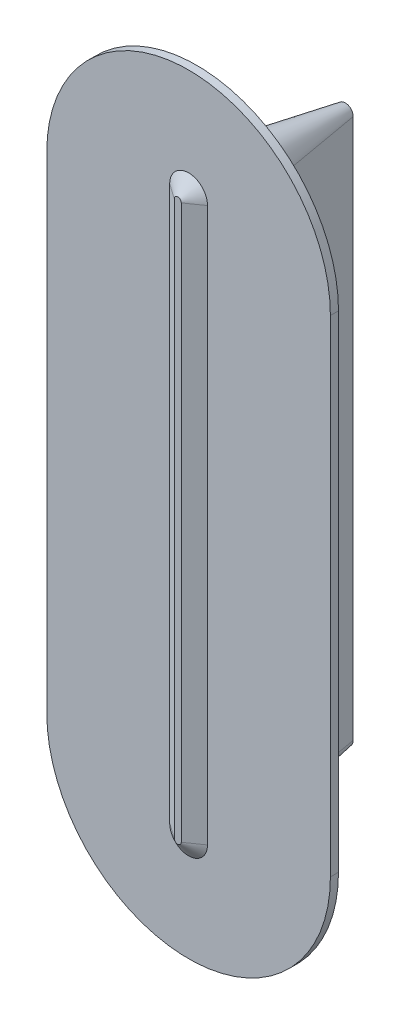
ISO-10303-21;
HEADER;
FILE_DESCRIPTION(('STEP AP214'),'2;1');
FILE_NAME('part.step','',(''),(''),'','','');
FILE_SCHEMA(('AUTOMOTIVE_DESIGN { 1 0 10303 214 1 1 1 1 }'));
ENDSEC;
DATA;
#1=APPLICATION_CONTEXT('core data for automotive mechanical design processes');
#2=APPLICATION_PROTOCOL_DEFINITION('international standard','automotive_design',2000,#1);
#3=PRODUCT_CONTEXT('',#1,'mechanical');
#4=PRODUCT('Part','Part','',(#3));
#5=PRODUCT_RELATED_PRODUCT_CATEGORY('part','',(#4));
#6=PRODUCT_DEFINITION_FORMATION('','',#4);
#7=PRODUCT_DEFINITION_CONTEXT('part definition',#1,'design');
#8=PRODUCT_DEFINITION('design','',#6,#7);
#9=PRODUCT_DEFINITION_SHAPE('','',#8);
#10=(LENGTH_UNIT() NAMED_UNIT(*) SI_UNIT(.MILLI.,.METRE.));
#11=(NAMED_UNIT(*) PLANE_ANGLE_UNIT() SI_UNIT($,.RADIAN.));
#12=(NAMED_UNIT(*) SI_UNIT($,.STERADIAN.) SOLID_ANGLE_UNIT());
#13=UNCERTAINTY_MEASURE_WITH_UNIT(LENGTH_MEASURE(1.E-05),#10,'distance_accuracy_value','');
#14=(GEOMETRIC_REPRESENTATION_CONTEXT(3) GLOBAL_UNCERTAINTY_ASSIGNED_CONTEXT((#13)) GLOBAL_UNIT_ASSIGNED_CONTEXT((#10,
#11,#12)) REPRESENTATION_CONTEXT('',''));
#15=CARTESIAN_POINT('',(0.,0.,0.));
#16=DIRECTION('',(0.,0.,1.));
#17=DIRECTION('',(1.,0.,0.));
#18=AXIS2_PLACEMENT_3D('',#15,#16,#17);
#19=CARTESIAN_POINT('',(0.,-90.,18.));
#20=DIRECTION('',(0.,0.,1.));
#21=DIRECTION('',(1.,0.,0.));
#22=AXIS2_PLACEMENT_3D('',#19,#20,#21);
#23=PLANE('',#22);
#24=CARTESIAN_POINT('',(0.,-90.,18.));
#25=DIRECTION('',(0.,0.,1.));
#26=DIRECTION('',(1.,0.,0.));
#27=AXIS2_PLACEMENT_3D('',#24,#25,#26);
#28=CIRCLE('',#27,52.5);
#29=CARTESIAN_POINT('',(-52.5,-90.,18.));
#30=VERTEX_POINT('',#29);
#31=CARTESIAN_POINT('',(52.5,-90.,18.));
#32=VERTEX_POINT('',#31);
#33=EDGE_CURVE('E203',#30,#32,#28,.T.);
#34=ORIENTED_EDGE('',*,*,#33,.T.);
#35=DIRECTION('',(0.,1.,0.));
#36=VECTOR('',#35,1.);
#37=CARTESIAN_POINT('',(52.5,-90.,18.));
#38=LINE('',#37,#36);
#39=CARTESIAN_POINT('',(52.5,90.,18.));
#40=VERTEX_POINT('',#39);
#41=EDGE_CURVE('E207',#32,#40,#38,.T.);
#42=ORIENTED_EDGE('',*,*,#41,.T.);
#43=CARTESIAN_POINT('',(0.,90.,18.));
#44=DIRECTION('',(0.,0.,1.));
#45=DIRECTION('',(1.,0.,0.));
#46=AXIS2_PLACEMENT_3D('',#43,#44,#45);
#47=CIRCLE('',#46,52.5);
#48=CARTESIAN_POINT('',(-52.5,90.,18.));
#49=VERTEX_POINT('',#48);
#50=EDGE_CURVE('E211',#40,#49,#47,.T.);
#51=ORIENTED_EDGE('',*,*,#50,.T.);
#52=DIRECTION('',(0.,-1.,0.));
#53=VECTOR('',#52,1.);
#54=CARTESIAN_POINT('',(-52.5,-90.,18.));
#55=LINE('',#54,#53);
#56=EDGE_CURVE('E214',#49,#30,#55,.T.);
#57=ORIENTED_EDGE('',*,*,#56,.T.);
#58=EDGE_LOOP('',(#34,#42,#51,#57));
#59=FACE_BOUND('',#58,.T.);
#60=DIRECTION('',(0.,1.,0.));
#61=VECTOR('',#60,1.);
#62=CARTESIAN_POINT('',(7.,-102.5,18.));
#63=LINE('',#62,#61);
#64=CARTESIAN_POINT('',(7.,-102.5,18.));
#65=VERTEX_POINT('',#64);
#66=CARTESIAN_POINT('',(6.99999999999996,102.5,18.));
#67=VERTEX_POINT('',#66);
#68=EDGE_CURVE('E154',#65,#67,#63,.T.);
#69=ORIENTED_EDGE('',*,*,#68,.F.);
#70=CARTESIAN_POINT('',(0.,-102.5,18.));
#71=DIRECTION('',(0.,0.,1.));
#72=DIRECTION('',(1.,0.,0.));
#73=AXIS2_PLACEMENT_3D('',#70,#71,#72);
#74=CIRCLE('',#73,6.99999999999999);
#75=CARTESIAN_POINT('',(-6.99999999999998,-102.5,18.));
#76=VERTEX_POINT('',#75);
#77=EDGE_CURVE('E166',#76,#65,#74,.T.);
#78=ORIENTED_EDGE('',*,*,#77,.F.);
#79=DIRECTION('',(0.,-1.,0.));
#80=VECTOR('',#79,1.);
#81=CARTESIAN_POINT('',(-6.99999999999998,-102.5,18.));
#82=LINE('',#81,#80);
#83=CARTESIAN_POINT('',(-7.,102.5,18.));
#84=VERTEX_POINT('',#83);
#85=EDGE_CURVE('E181',#84,#76,#82,.T.);
#86=ORIENTED_EDGE('',*,*,#85,.F.);
#87=CARTESIAN_POINT('',(0.,102.5,18.));
#88=DIRECTION('',(0.,0.,1.));
#89=DIRECTION('',(1.,0.,0.));
#90=AXIS2_PLACEMENT_3D('',#87,#88,#89);
#91=CIRCLE('',#90,7.);
#92=EDGE_CURVE('E175',#67,#84,#91,.T.);
#93=ORIENTED_EDGE('',*,*,#92,.F.);
#94=EDGE_LOOP('',(#69,#78,#86,#93));
#95=FACE_BOUND('',#94,.T.);
#96=ADVANCED_FACE('F36',(#59,#95),#23,.T.);
#97=CARTESIAN_POINT('',(0.,-100.,0.));
#98=DIRECTION('',(0.,0.,1.));
#99=DIRECTION('',(1.,0.,0.));
#100=AXIS2_PLACEMENT_3D('',#97,#98,#99);
#101=CONICAL_SURFACE('',#100,9.99999999999999,0.174532925199433);
#102=CARTESIAN_POINT('',(0.,-100.,0.));
#103=DIRECTION('',(0.,0.,1.));
#104=DIRECTION('',(1.,0.,0.));
#105=AXIS2_PLACEMENT_3D('',#102,#103,#104);
#106=CIRCLE('',#105,9.99999999999999);
#107=CARTESIAN_POINT('',(-9.99999999999998,-100.,0.));
#108=VERTEX_POINT('',#107);
#109=CARTESIAN_POINT('',(10.,-100.,0.));
#110=VERTEX_POINT('',#109);
#111=EDGE_CURVE('E276',#108,#110,#106,.T.);
#112=ORIENTED_EDGE('',*,*,#111,.F.);
#113=DIRECTION('',(-0.173648177666931,0.,0.984807753012208));
#114=VECTOR('',#113,1.);
#115=CARTESIAN_POINT('',(-9.99999999999998,-100.,0.));
#116=LINE('',#115,#114);
#117=CARTESIAN_POINT('',(-2.94692077166136,-100.,-40.));
#118=VERTEX_POINT('',#117);
#119=EDGE_CURVE('E11',#118,#108,#116,.T.);
#120=ORIENTED_EDGE('',*,*,#119,.F.);
#121=CARTESIAN_POINT('',(0.,-100.,-40.));
#122=DIRECTION('',(0.,0.,1.));
#123=DIRECTION('',(1.,0.,0.));
#124=AXIS2_PLACEMENT_3D('',#121,#122,#123);
#125=CIRCLE('',#124,2.94692077166137);
#126=CARTESIAN_POINT('',(2.94692077166137,-100.,-40.));
#127=VERTEX_POINT('',#126);
#128=EDGE_CURVE('E291',#118,#127,#125,.T.);
#129=ORIENTED_EDGE('',*,*,#128,.T.);
#130=DIRECTION('',(0.173648177666931,0.,0.984807753012208));
#131=VECTOR('',#130,1.);
#132=CARTESIAN_POINT('',(9.99999999999999,-100.,0.));
#133=LINE('',#132,#131);
#134=EDGE_CURVE('E77',#127,#110,#133,.T.);
#135=ORIENTED_EDGE('',*,*,#134,.T.);
#136=EDGE_LOOP('',(#112,#120,#129,#135));
#137=FACE_BOUND('',#136,.T.);
#138=ADVANCED_FACE('F310',(#137),#101,.T.);
#139=CARTESIAN_POINT('',(-9.99999999999998,-100.,0.));
#140=DIRECTION('',(-0.984807753012208,0.,-0.173648177666931));
#141=DIRECTION('',(-0.173648177666931,0.,0.984807753012208));
#142=AXIS2_PLACEMENT_3D('',#139,#140,#141);
#143=PLANE('',#142);
#144=DIRECTION('',(0.,-1.,0.));
#145=VECTOR('',#144,1.);
#146=CARTESIAN_POINT('',(-9.99999999999998,-100.,0.));
#147=LINE('',#146,#145);
#148=CARTESIAN_POINT('',(-10.,100.,0.));
#149=VERTEX_POINT('',#148);
#150=EDGE_CURVE('E288',#149,#108,#147,.T.);
#151=ORIENTED_EDGE('',*,*,#150,.F.);
#152=DIRECTION('',(-0.173648177666931,0.,0.984807753012208));
#153=VECTOR('',#152,1.);
#154=CARTESIAN_POINT('',(-10.,100.,0.));
#155=LINE('',#154,#153);
#156=CARTESIAN_POINT('',(-2.94692077166142,100.,-40.));
#157=VERTEX_POINT('',#156);
#158=EDGE_CURVE('E46',#157,#149,#155,.T.);
#159=ORIENTED_EDGE('',*,*,#158,.F.);
#160=DIRECTION('',(0.,-1.,0.));
#161=VECTOR('',#160,1.);
#162=CARTESIAN_POINT('',(-2.94692077166136,-100.,-40.));
#163=LINE('',#162,#161);
#164=EDGE_CURVE('E295',#157,#118,#163,.T.);
#165=ORIENTED_EDGE('',*,*,#164,.T.);
#166=ORIENTED_EDGE('',*,*,#119,.T.);
#167=EDGE_LOOP('',(#151,#159,#165,#166));
#168=FACE_BOUND('',#167,.T.);
#169=ADVANCED_FACE('F38',(#168),#143,.T.);
#170=CARTESIAN_POINT('',(0.,100.,0.));
#171=DIRECTION('',(0.,0.,1.));
#172=DIRECTION('',(1.,0.,0.));
#173=AXIS2_PLACEMENT_3D('',#170,#171,#172);
#174=CONICAL_SURFACE('',#173,10.,0.174532925199433);
#175=CARTESIAN_POINT('',(0.,100.,0.));
#176=DIRECTION('',(0.,0.,1.));
#177=DIRECTION('',(1.,0.,0.));
#178=AXIS2_PLACEMENT_3D('',#175,#176,#177);
#179=CIRCLE('',#178,10.);
#180=CARTESIAN_POINT('',(9.99999999999996,100.,0.));
#181=VERTEX_POINT('',#180);
#182=EDGE_CURVE('E284',#181,#149,#179,.T.);
#183=ORIENTED_EDGE('',*,*,#182,.F.);
#184=DIRECTION('',(0.173648177666931,0.,0.984807753012208));
#185=VECTOR('',#184,1.);
#186=CARTESIAN_POINT('',(10.,100.,0.));
#187=LINE('',#186,#185);
#188=CARTESIAN_POINT('',(2.94692077166139,100.,-40.));
#189=VERTEX_POINT('',#188);
#190=EDGE_CURVE('E87',#189,#181,#187,.T.);
#191=ORIENTED_EDGE('',*,*,#190,.F.);
#192=CARTESIAN_POINT('',(0.,100.,-40.));
#193=DIRECTION('',(0.,0.,1.));
#194=DIRECTION('',(1.,0.,0.));
#195=AXIS2_PLACEMENT_3D('',#192,#193,#194);
#196=CIRCLE('',#195,2.94692077166139);
#197=EDGE_CURVE('E302',#189,#157,#196,.T.);
#198=ORIENTED_EDGE('',*,*,#197,.T.);
#199=ORIENTED_EDGE('',*,*,#158,.T.);
#200=EDGE_LOOP('',(#183,#191,#198,#199));
#201=FACE_BOUND('',#200,.T.);
#202=ADVANCED_FACE('F325',(#201),#174,.T.);
#203=CARTESIAN_POINT('',(10.,-100.,0.));
#204=DIRECTION('',(0.984807753012208,0.,-0.173648177666931));
#205=DIRECTION('',(-0.173648177666931,0.,-0.984807753012208));
#206=AXIS2_PLACEMENT_3D('',#203,#204,#205);
#207=PLANE('',#206);
#208=DIRECTION('',(0.,1.,0.));
#209=VECTOR('',#208,1.);
#210=CARTESIAN_POINT('',(10.,-100.,0.));
#211=LINE('',#210,#209);
#212=EDGE_CURVE('E280',#110,#181,#211,.T.);
#213=ORIENTED_EDGE('',*,*,#212,.F.);
#214=ORIENTED_EDGE('',*,*,#134,.F.);
#215=DIRECTION('',(0.,1.,0.));
#216=VECTOR('',#215,1.);
#217=CARTESIAN_POINT('',(2.94692077166139,-100.,-40.));
#218=LINE('',#217,#216);
#219=EDGE_CURVE('E40',#127,#189,#218,.T.);
#220=ORIENTED_EDGE('',*,*,#219,.T.);
#221=ORIENTED_EDGE('',*,*,#190,.T.);
#222=EDGE_LOOP('',(#213,#214,#220,#221));
#223=FACE_BOUND('',#222,.T.);
#224=ADVANCED_FACE('F307',(#223),#207,.T.);
#225=CARTESIAN_POINT('',(0.,-100.,-40.));
#226=DIRECTION('',(0.,0.,1.));
#227=DIRECTION('',(1.,0.,0.));
#228=AXIS2_PLACEMENT_3D('',#225,#226,#227);
#229=PLANE('',#228);
#230=ORIENTED_EDGE('',*,*,#128,.F.);
#231=ORIENTED_EDGE('',*,*,#164,.F.);
#232=ORIENTED_EDGE('',*,*,#197,.F.);
#233=ORIENTED_EDGE('',*,*,#219,.F.);
#234=EDGE_LOOP('',(#230,#231,#232,#233));
#235=FACE_BOUND('',#234,.T.);
#236=ADVANCED_FACE('F309',(#235),#229,.F.);
#237=CARTESIAN_POINT('',(0.,-100.,15.));
#238=DIRECTION('',(0.,0.,-1.));
#239=DIRECTION('',(-1.,0.,0.));
#240=AXIS2_PLACEMENT_3D('',#237,#238,#239);
#241=CYLINDRICAL_SURFACE('',#240,9.99999999999999);
#242=ORIENTED_EDGE('',*,*,#111,.T.);
#243=DIRECTION('',(0.,0.,-1.));
#244=VECTOR('',#243,1.);
#245=CARTESIAN_POINT('',(10.,-100.,15.));
#246=LINE('',#245,#244);
#247=CARTESIAN_POINT('',(10.,-100.,15.));
#248=VERTEX_POINT('',#247);
#249=EDGE_CURVE('E272',#248,#110,#246,.T.);
#250=ORIENTED_EDGE('',*,*,#249,.F.);
#251=CARTESIAN_POINT('',(0.,-100.,15.));
#252=DIRECTION('',(0.,0.,1.));
#253=DIRECTION('',(1.,0.,0.));
#254=AXIS2_PLACEMENT_3D('',#251,#252,#253);
#255=CIRCLE('',#254,9.99999999999999);
#256=CARTESIAN_POINT('',(-9.99999999999998,-100.,15.));
#257=VERTEX_POINT('',#256);
#258=EDGE_CURVE('E244',#257,#248,#255,.T.);
#259=ORIENTED_EDGE('',*,*,#258,.F.);
#260=DIRECTION('',(0.,0.,-1.));
#261=VECTOR('',#260,1.);
#262=CARTESIAN_POINT('',(-9.99999999999998,-100.,15.));
#263=LINE('',#262,#261);
#264=EDGE_CURVE('E260',#257,#108,#263,.T.);
#265=ORIENTED_EDGE('',*,*,#264,.T.);
#266=EDGE_LOOP('',(#242,#250,#259,#265));
#267=FACE_BOUND('',#266,.T.);
#268=ADVANCED_FACE('F315',(#267),#241,.T.);
#269=CARTESIAN_POINT('',(10.,-100.,15.));
#270=DIRECTION('',(-1.,0.,0.));
#271=DIRECTION('',(0.,0.,1.));
#272=AXIS2_PLACEMENT_3D('',#269,#270,#271);
#273=PLANE('',#272);
#274=ORIENTED_EDGE('',*,*,#212,.T.);
#275=DIRECTION('',(0.,0.,-1.));
#276=VECTOR('',#275,1.);
#277=CARTESIAN_POINT('',(9.99999999999996,100.,15.));
#278=LINE('',#277,#276);
#279=CARTESIAN_POINT('',(9.99999999999996,100.,15.));
#280=VERTEX_POINT('',#279);
#281=EDGE_CURVE('E268',#280,#181,#278,.T.);
#282=ORIENTED_EDGE('',*,*,#281,.F.);
#283=DIRECTION('',(0.,1.,0.));
#284=VECTOR('',#283,1.);
#285=CARTESIAN_POINT('',(10.,-100.,15.));
#286=LINE('',#285,#284);
#287=EDGE_CURVE('E248',#248,#280,#286,.T.);
#288=ORIENTED_EDGE('',*,*,#287,.F.);
#289=ORIENTED_EDGE('',*,*,#249,.T.);
#290=EDGE_LOOP('',(#274,#282,#288,#289));
#291=FACE_BOUND('',#290,.T.);
#292=ADVANCED_FACE('F313',(#291),#273,.F.);
#293=CARTESIAN_POINT('',(0.,100.,15.));
#294=DIRECTION('',(0.,0.,-1.));
#295=DIRECTION('',(-1.,0.,0.));
#296=AXIS2_PLACEMENT_3D('',#293,#294,#295);
#297=CYLINDRICAL_SURFACE('',#296,10.);
#298=ORIENTED_EDGE('',*,*,#182,.T.);
#299=DIRECTION('',(0.,0.,-1.));
#300=VECTOR('',#299,1.);
#301=CARTESIAN_POINT('',(-10.,100.,15.));
#302=LINE('',#301,#300);
#303=CARTESIAN_POINT('',(-10.,100.,15.));
#304=VERTEX_POINT('',#303);
#305=EDGE_CURVE('E264',#304,#149,#302,.T.);
#306=ORIENTED_EDGE('',*,*,#305,.F.);
#307=CARTESIAN_POINT('',(0.,100.,15.));
#308=DIRECTION('',(0.,0.,1.));
#309=DIRECTION('',(1.,0.,0.));
#310=AXIS2_PLACEMENT_3D('',#307,#308,#309);
#311=CIRCLE('',#310,10.);
#312=EDGE_CURVE('E252',#280,#304,#311,.T.);
#313=ORIENTED_EDGE('',*,*,#312,.F.);
#314=ORIENTED_EDGE('',*,*,#281,.T.);
#315=EDGE_LOOP('',(#298,#306,#313,#314));
#316=FACE_BOUND('',#315,.T.);
#317=ADVANCED_FACE('F324',(#316),#297,.T.);
#318=CARTESIAN_POINT('',(-9.99999999999998,-100.,15.));
#319=DIRECTION('',(1.,0.,0.));
#320=DIRECTION('',(0.,1.,0.));
#321=AXIS2_PLACEMENT_3D('',#318,#319,#320);
#322=PLANE('',#321);
#323=ORIENTED_EDGE('',*,*,#150,.T.);
#324=ORIENTED_EDGE('',*,*,#264,.F.);
#325=DIRECTION('',(0.,-1.,0.));
#326=VECTOR('',#325,1.);
#327=CARTESIAN_POINT('',(-9.99999999999998,-100.,15.));
#328=LINE('',#327,#326);
#329=EDGE_CURVE('E256',#304,#257,#328,.T.);
#330=ORIENTED_EDGE('',*,*,#329,.F.);
#331=ORIENTED_EDGE('',*,*,#305,.T.);
#332=EDGE_LOOP('',(#323,#324,#330,#331));
#333=FACE_BOUND('',#332,.T.);
#334=ADVANCED_FACE('F319',(#333),#322,.F.);
#335=CARTESIAN_POINT('',(0.,-90.,15.));
#336=DIRECTION('',(0.,0.,1.));
#337=DIRECTION('',(1.,0.,0.));
#338=AXIS2_PLACEMENT_3D('',#335,#336,#337);
#339=PLANE('',#338);
#340=CARTESIAN_POINT('',(0.,-90.,15.));
#341=DIRECTION('',(0.,0.,1.));
#342=DIRECTION('',(1.,0.,0.));
#343=AXIS2_PLACEMENT_3D('',#340,#341,#342);
#344=CIRCLE('',#343,52.5);
#345=CARTESIAN_POINT('',(-52.5,-90.,15.));
#346=VERTEX_POINT('',#345);
#347=CARTESIAN_POINT('',(52.5,-90.,15.));
#348=VERTEX_POINT('',#347);
#349=EDGE_CURVE('E161',#346,#348,#344,.T.);
#350=ORIENTED_EDGE('',*,*,#349,.F.);
#351=DIRECTION('',(0.,-1.,0.));
#352=VECTOR('',#351,1.);
#353=CARTESIAN_POINT('',(-52.5,-90.,15.));
#354=LINE('',#353,#352);
#355=CARTESIAN_POINT('',(-52.5,90.,15.));
#356=VERTEX_POINT('',#355);
#357=EDGE_CURVE('E208',#356,#346,#354,.T.);
#358=ORIENTED_EDGE('',*,*,#357,.F.);
#359=CARTESIAN_POINT('',(0.,90.,15.));
#360=DIRECTION('',(0.,0.,1.));
#361=DIRECTION('',(1.,0.,0.));
#362=AXIS2_PLACEMENT_3D('',#359,#360,#361);
#363=CIRCLE('',#362,52.5);
#364=CARTESIAN_POINT('',(52.5,90.,15.));
#365=VERTEX_POINT('',#364);
#366=EDGE_CURVE('E224',#365,#356,#363,.T.);
#367=ORIENTED_EDGE('',*,*,#366,.F.);
#368=DIRECTION('',(0.,1.,0.));
#369=VECTOR('',#368,1.);
#370=CARTESIAN_POINT('',(52.5,-90.,15.));
#371=LINE('',#370,#369);
#372=EDGE_CURVE('E221',#348,#365,#371,.T.);
#373=ORIENTED_EDGE('',*,*,#372,.F.);
#374=EDGE_LOOP('',(#350,#358,#367,#373));
#375=FACE_BOUND('',#374,.T.);
#376=ORIENTED_EDGE('',*,*,#329,.T.);
#377=ORIENTED_EDGE('',*,*,#258,.T.);
#378=ORIENTED_EDGE('',*,*,#287,.T.);
#379=ORIENTED_EDGE('',*,*,#312,.T.);
#380=EDGE_LOOP('',(#376,#377,#378,#379));
#381=FACE_BOUND('',#380,.T.);
#382=ADVANCED_FACE('F321',(#375,#381),#339,.F.);
#383=CARTESIAN_POINT('',(0.,-90.,18.));
#384=DIRECTION('',(0.,0.,-1.));
#385=DIRECTION('',(-1.,0.,0.));
#386=AXIS2_PLACEMENT_3D('',#383,#384,#385);
#387=CYLINDRICAL_SURFACE('',#386,52.5);
#388=ORIENTED_EDGE('',*,*,#349,.T.);
#389=DIRECTION('',(0.,0.,-1.));
#390=VECTOR('',#389,1.);
#391=CARTESIAN_POINT('',(52.5,-90.,18.));
#392=LINE('',#391,#390);
#393=EDGE_CURVE('E240',#32,#348,#392,.T.);
#394=ORIENTED_EDGE('',*,*,#393,.F.);
#395=ORIENTED_EDGE('',*,*,#33,.F.);
#396=DIRECTION('',(0.,0.,-1.));
#397=VECTOR('',#396,1.);
#398=CARTESIAN_POINT('',(-52.5,-90.,18.));
#399=LINE('',#398,#397);
#400=EDGE_CURVE('E217',#30,#346,#399,.T.);
#401=ORIENTED_EDGE('',*,*,#400,.T.);
#402=EDGE_LOOP('',(#388,#394,#395,#401));
#403=FACE_BOUND('',#402,.T.);
#404=ADVANCED_FACE('F345',(#403),#387,.T.);
#405=CARTESIAN_POINT('',(52.5,-90.,18.));
#406=DIRECTION('',(-1.,0.,0.));
#407=DIRECTION('',(0.,0.,1.));
#408=AXIS2_PLACEMENT_3D('',#405,#406,#407);
#409=PLANE('',#408);
#410=ORIENTED_EDGE('',*,*,#372,.T.);
#411=DIRECTION('',(0.,0.,-1.));
#412=VECTOR('',#411,1.);
#413=CARTESIAN_POINT('',(52.5,90.,18.));
#414=LINE('',#413,#412);
#415=EDGE_CURVE('E236',#40,#365,#414,.T.);
#416=ORIENTED_EDGE('',*,*,#415,.F.);
#417=ORIENTED_EDGE('',*,*,#41,.F.);
#418=ORIENTED_EDGE('',*,*,#393,.T.);
#419=EDGE_LOOP('',(#410,#416,#417,#418));
#420=FACE_BOUND('',#419,.T.);
#421=ADVANCED_FACE('F354',(#420),#409,.F.);
#422=CARTESIAN_POINT('',(0.,90.,18.));
#423=DIRECTION('',(0.,0.,-1.));
#424=DIRECTION('',(-1.,0.,0.));
#425=AXIS2_PLACEMENT_3D('',#422,#423,#424);
#426=CYLINDRICAL_SURFACE('',#425,52.5);
#427=ORIENTED_EDGE('',*,*,#366,.T.);
#428=DIRECTION('',(0.,0.,-1.));
#429=VECTOR('',#428,1.);
#430=CARTESIAN_POINT('',(-52.5,90.,18.));
#431=LINE('',#430,#429);
#432=EDGE_CURVE('E232',#49,#356,#431,.T.);
#433=ORIENTED_EDGE('',*,*,#432,.F.);
#434=ORIENTED_EDGE('',*,*,#50,.F.);
#435=ORIENTED_EDGE('',*,*,#415,.T.);
#436=EDGE_LOOP('',(#427,#433,#434,#435));
#437=FACE_BOUND('',#436,.T.);
#438=ADVANCED_FACE('F350',(#437),#426,.T.);
#439=CARTESIAN_POINT('',(-52.5,-90.,18.));
#440=DIRECTION('',(1.,0.,0.));
#441=DIRECTION('',(0.,1.,0.));
#442=AXIS2_PLACEMENT_3D('',#439,#440,#441);
#443=PLANE('',#442);
#444=ORIENTED_EDGE('',*,*,#357,.T.);
#445=ORIENTED_EDGE('',*,*,#400,.F.);
#446=ORIENTED_EDGE('',*,*,#56,.F.);
#447=ORIENTED_EDGE('',*,*,#432,.T.);
#448=EDGE_LOOP('',(#444,#445,#446,#447));
#449=FACE_BOUND('',#448,.T.);
#450=ADVANCED_FACE('F347',(#449),#443,.F.);
#451=CARTESIAN_POINT('',(0.,-102.5,18.));
#452=DIRECTION('',(0.,0.,-1.));
#453=DIRECTION('',(1.,0.,0.));
#454=AXIS2_PLACEMENT_3D('',#451,#452,#453);
#455=CONICAL_SURFACE('',#454,6.99999999999999,0.959931088596883);
#456=ORIENTED_EDGE('',*,*,#77,.T.);
#457=DIRECTION('',(0.819152044288993,0.,-0.573576436351044));
#458=VECTOR('',#457,1.);
#459=CARTESIAN_POINT('',(7.,-102.5,18.));
#460=LINE('',#459,#458);
#461=CARTESIAN_POINT('',(1.28740797303152,-102.5,22.));
#462=VERTEX_POINT('',#461);
#463=EDGE_CURVE('E149',#462,#65,#460,.T.);
#464=ORIENTED_EDGE('',*,*,#463,.F.);
#465=CARTESIAN_POINT('',(0.,-102.5,22.));
#466=DIRECTION('',(0.,0.,1.));
#467=DIRECTION('',(1.,0.,0.));
#468=AXIS2_PLACEMENT_3D('',#465,#466,#467);
#469=CIRCLE('',#468,1.2874079730315);
#470=CARTESIAN_POINT('',(-1.28740797303151,-102.5,22.));
#471=VERTEX_POINT('',#470);
#472=EDGE_CURVE('E185',#471,#462,#469,.T.);
#473=ORIENTED_EDGE('',*,*,#472,.F.);
#474=DIRECTION('',(-0.819152044288993,0.,-0.573576436351044));
#475=VECTOR('',#474,1.);
#476=CARTESIAN_POINT('',(-6.99999999999998,-102.5,18.));
#477=LINE('',#476,#475);
#478=EDGE_CURVE('E169',#471,#76,#477,.T.);
#479=ORIENTED_EDGE('',*,*,#478,.T.);
#480=EDGE_LOOP('',(#456,#464,#473,#479));
#481=FACE_BOUND('',#480,.T.);
#482=ADVANCED_FACE('F167',(#481),#455,.T.);
#483=CARTESIAN_POINT('',(7.,-102.5,18.));
#484=DIRECTION('',(0.573576436351044,0.,0.819152044288993));
#485=DIRECTION('',(0.819152044288993,0.,-0.573576436351044));
#486=AXIS2_PLACEMENT_3D('',#483,#484,#485);
#487=PLANE('',#486);
#488=ORIENTED_EDGE('',*,*,#68,.T.);
#489=DIRECTION('',(0.819152044288993,0.,-0.573576436351044));
#490=VECTOR('',#489,1.);
#491=CARTESIAN_POINT('',(6.99999999999996,102.5,18.));
#492=LINE('',#491,#490);
#493=CARTESIAN_POINT('',(1.28740797303148,102.5,22.));
#494=VERTEX_POINT('',#493);
#495=EDGE_CURVE('E162',#494,#67,#492,.T.);
#496=ORIENTED_EDGE('',*,*,#495,.F.);
#497=DIRECTION('',(0.,-1.,0.));
#498=VECTOR('',#497,1.);
#499=CARTESIAN_POINT('',(1.28740797303152,-102.5,22.));
#500=LINE('',#499,#498);
#501=EDGE_CURVE('E156',#462,#494,#500,.F.);
#502=ORIENTED_EDGE('',*,*,#501,.F.);
#503=ORIENTED_EDGE('',*,*,#463,.T.);
#504=EDGE_LOOP('',(#488,#496,#502,#503));
#505=FACE_BOUND('',#504,.T.);
#506=ADVANCED_FACE('F151',(#505),#487,.T.);
#507=CARTESIAN_POINT('',(0.,102.5,18.));
#508=DIRECTION('',(0.,0.,-1.));
#509=DIRECTION('',(1.,0.,0.));
#510=AXIS2_PLACEMENT_3D('',#507,#508,#509);
#511=CONICAL_SURFACE('',#510,7.,0.959931088596883);
#512=ORIENTED_EDGE('',*,*,#92,.T.);
#513=DIRECTION('',(-0.819152044288993,0.,-0.573576436351044));
#514=VECTOR('',#513,1.);
#515=CARTESIAN_POINT('',(-7.,102.5,18.));
#516=LINE('',#515,#514);
#517=CARTESIAN_POINT('',(-1.28740797303152,102.5,22.));
#518=VERTEX_POINT('',#517);
#519=EDGE_CURVE('E54',#518,#84,#516,.T.);
#520=ORIENTED_EDGE('',*,*,#519,.F.);
#521=CARTESIAN_POINT('',(0.,102.5,22.));
#522=DIRECTION('',(0.,0.,1.));
#523=DIRECTION('',(1.,0.,0.));
#524=AXIS2_PLACEMENT_3D('',#521,#522,#523);
#525=CIRCLE('',#524,1.28740797303152);
#526=EDGE_CURVE('E198',#494,#518,#525,.T.);
#527=ORIENTED_EDGE('',*,*,#526,.F.);
#528=ORIENTED_EDGE('',*,*,#495,.T.);
#529=EDGE_LOOP('',(#512,#520,#527,#528));
#530=FACE_BOUND('',#529,.T.);
#531=ADVANCED_FACE('F412',(#530),#511,.T.);
#532=CARTESIAN_POINT('',(-6.99999999999998,-102.5,18.));
#533=DIRECTION('',(-0.573576436351044,0.,0.819152044288993));
#534=DIRECTION('',(0.819152044288993,0.,0.573576436351044));
#535=AXIS2_PLACEMENT_3D('',#532,#533,#534);
#536=PLANE('',#535);
#537=ORIENTED_EDGE('',*,*,#85,.T.);
#538=ORIENTED_EDGE('',*,*,#478,.F.);
#539=DIRECTION('',(0.,1.,0.));
#540=VECTOR('',#539,1.);
#541=CARTESIAN_POINT('',(-1.28740797303149,-102.5,22.));
#542=LINE('',#541,#540);
#543=EDGE_CURVE('E189',#518,#471,#542,.F.);
#544=ORIENTED_EDGE('',*,*,#543,.F.);
#545=ORIENTED_EDGE('',*,*,#519,.T.);
#546=EDGE_LOOP('',(#537,#538,#544,#545));
#547=FACE_BOUND('',#546,.T.);
#548=ADVANCED_FACE('F417',(#547),#536,.T.);
#549=CARTESIAN_POINT('',(0.,-102.5,22.));
#550=DIRECTION('',(0.,0.,1.));
#551=DIRECTION('',(1.,0.,0.));
#552=AXIS2_PLACEMENT_3D('',#549,#550,#551);
#553=PLANE('',#552);
#554=ORIENTED_EDGE('',*,*,#472,.T.);
#555=ORIENTED_EDGE('',*,*,#501,.T.);
#556=ORIENTED_EDGE('',*,*,#526,.T.);
#557=ORIENTED_EDGE('',*,*,#543,.T.);
#558=EDGE_LOOP('',(#554,#555,#556,#557));
#559=FACE_BOUND('',#558,.T.);
#560=ADVANCED_FACE('F423',(#559),#553,.T.);
#561=CLOSED_SHELL('',(#96,#138,#169,#202,#224,#236,#268,#292,#317,#334,#382,#404,#421,#438,#450,
#482,#506,#531,#548,#560));
#562=MANIFOLD_SOLID_BREP('B2',#561);
#563=ADVANCED_BREP_SHAPE_REPRESENTATION('',(#18,#562),#14);
#564=SHAPE_DEFINITION_REPRESENTATION(#9,#563);
ENDSEC;
END-ISO-10303-21;
